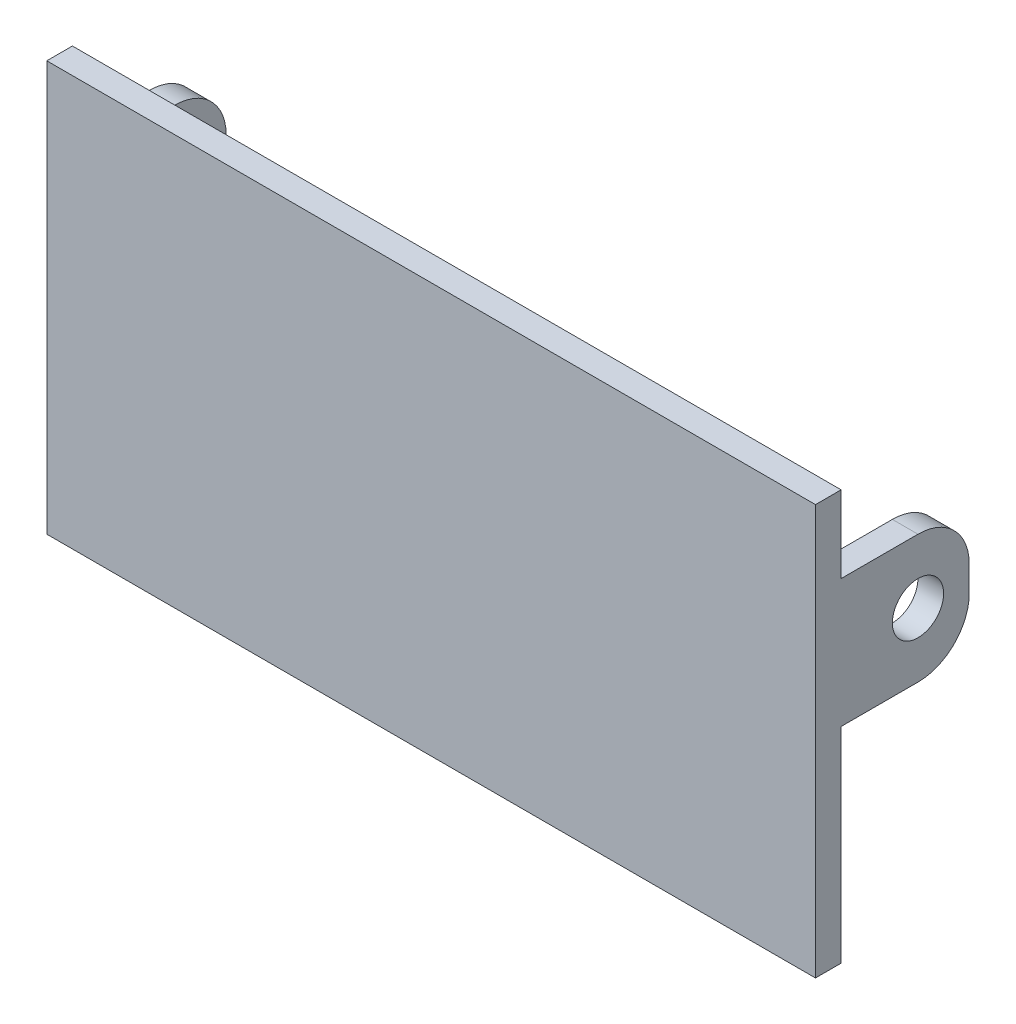
ISO-10303-21;
HEADER;
FILE_DESCRIPTION(('STEP AP214'),'2;1');
FILE_NAME('part.step','',(''),(''),'','','');
FILE_SCHEMA(('AUTOMOTIVE_DESIGN { 1 0 10303 214 1 1 1 1 }'));
ENDSEC;
DATA;
#1=APPLICATION_CONTEXT('core data for automotive mechanical design processes');
#2=APPLICATION_PROTOCOL_DEFINITION('international standard','automotive_design',2000,#1);
#3=PRODUCT_CONTEXT('',#1,'mechanical');
#4=PRODUCT('Part','Part','',(#3));
#5=PRODUCT_RELATED_PRODUCT_CATEGORY('part','',(#4));
#6=PRODUCT_DEFINITION_FORMATION('','',#4);
#7=PRODUCT_DEFINITION_CONTEXT('part definition',#1,'design');
#8=PRODUCT_DEFINITION('design','',#6,#7);
#9=PRODUCT_DEFINITION_SHAPE('','',#8);
#10=(LENGTH_UNIT() NAMED_UNIT(*) SI_UNIT(.MILLI.,.METRE.));
#11=(NAMED_UNIT(*) PLANE_ANGLE_UNIT() SI_UNIT($,.RADIAN.));
#12=(NAMED_UNIT(*) SI_UNIT($,.STERADIAN.) SOLID_ANGLE_UNIT());
#13=UNCERTAINTY_MEASURE_WITH_UNIT(LENGTH_MEASURE(1.E-05),#10,'distance_accuracy_value','');
#14=(GEOMETRIC_REPRESENTATION_CONTEXT(3) GLOBAL_UNCERTAINTY_ASSIGNED_CONTEXT((#13)) GLOBAL_UNIT_ASSIGNED_CONTEXT((#10,
#11,#12)) REPRESENTATION_CONTEXT('',''));
#15=CARTESIAN_POINT('',(0.,0.,0.));
#16=DIRECTION('',(0.,0.,1.));
#17=DIRECTION('',(1.,0.,0.));
#18=AXIS2_PLACEMENT_3D('',#15,#16,#17);
#19=CARTESIAN_POINT('',(0.,0.,0.));
#20=DIRECTION('',(0.,0.,1.));
#21=DIRECTION('',(1.,0.,0.));
#22=AXIS2_PLACEMENT_3D('',#19,#20,#21);
#23=PLANE('',#22);
#24=DIRECTION('',(1.,0.,0.));
#25=VECTOR('',#24,1.);
#26=CARTESIAN_POINT('',(-150.,65.,0.));
#27=LINE('',#26,#25);
#28=CARTESIAN_POINT('',(-150.,65.,0.));
#29=VERTEX_POINT('',#28);
#30=CARTESIAN_POINT('',(-145.,65.,0.));
#31=VERTEX_POINT('',#30);
#32=EDGE_CURVE('E151',#29,#31,#27,.T.);
#33=ORIENTED_EDGE('',*,*,#32,.F.);
#34=DIRECTION('',(0.,1.,0.));
#35=VECTOR('',#34,1.);
#36=CARTESIAN_POINT('',(-150.,0.,0.));
#37=LINE('',#36,#35);
#38=CARTESIAN_POINT('',(-150.,80.,0.));
#39=VERTEX_POINT('',#38);
#40=EDGE_CURVE('E160',#29,#39,#37,.T.);
#41=ORIENTED_EDGE('',*,*,#40,.T.);
#42=DIRECTION('',(-1.,0.,0.));
#43=VECTOR('',#42,1.);
#44=CARTESIAN_POINT('',(0.,80.,0.));
#45=LINE('',#44,#43);
#46=CARTESIAN_POINT('',(0.,80.,0.));
#47=VERTEX_POINT('',#46);
#48=EDGE_CURVE('E169',#47,#39,#45,.T.);
#49=ORIENTED_EDGE('',*,*,#48,.F.);
#50=DIRECTION('',(0.,1.,0.));
#51=VECTOR('',#50,1.);
#52=CARTESIAN_POINT('',(0.,0.,0.));
#53=LINE('',#52,#51);
#54=CARTESIAN_POINT('',(0.,65.,0.));
#55=VERTEX_POINT('',#54);
#56=EDGE_CURVE('E216',#55,#47,#53,.T.);
#57=ORIENTED_EDGE('',*,*,#56,.F.);
#58=DIRECTION('',(1.,0.,0.));
#59=VECTOR('',#58,1.);
#60=CARTESIAN_POINT('',(0.,65.,0.));
#61=LINE('',#60,#59);
#62=CARTESIAN_POINT('',(-5.,65.,0.));
#63=VERTEX_POINT('',#62);
#64=EDGE_CURVE('E198',#63,#55,#61,.T.);
#65=ORIENTED_EDGE('',*,*,#64,.F.);
#66=DIRECTION('',(0.,1.,0.));
#67=VECTOR('',#66,1.);
#68=CARTESIAN_POINT('',(-5.,65.,0.));
#69=LINE('',#68,#67);
#70=CARTESIAN_POINT('',(-5.00000000000001,40.,0.));
#71=VERTEX_POINT('',#70);
#72=EDGE_CURVE('E204',#71,#63,#69,.T.);
#73=ORIENTED_EDGE('',*,*,#72,.F.);
#74=DIRECTION('',(-1.,0.,0.));
#75=VECTOR('',#74,1.);
#76=CARTESIAN_POINT('',(0.,40.,0.));
#77=LINE('',#76,#75);
#78=CARTESIAN_POINT('',(0.,40.,0.));
#79=VERTEX_POINT('',#78);
#80=EDGE_CURVE('E156',#79,#71,#77,.T.);
#81=ORIENTED_EDGE('',*,*,#80,.F.);
#82=CARTESIAN_POINT('',(0.,0.,0.));
#83=VERTEX_POINT('',#82);
#84=EDGE_CURVE('E229',#83,#79,#53,.T.);
#85=ORIENTED_EDGE('',*,*,#84,.F.);
#86=DIRECTION('',(-1.,0.,0.));
#87=VECTOR('',#86,1.);
#88=CARTESIAN_POINT('',(0.,0.,0.));
#89=LINE('',#88,#87);
#90=CARTESIAN_POINT('',(-150.,0.,0.));
#91=VERTEX_POINT('',#90);
#92=EDGE_CURVE('E221',#83,#91,#89,.T.);
#93=ORIENTED_EDGE('',*,*,#92,.T.);
#94=CARTESIAN_POINT('',(-150.,40.,0.));
#95=VERTEX_POINT('',#94);
#96=EDGE_CURVE('E168',#91,#95,#37,.T.);
#97=ORIENTED_EDGE('',*,*,#96,.T.);
#98=DIRECTION('',(-1.,0.,0.));
#99=VECTOR('',#98,1.);
#100=CARTESIAN_POINT('',(-150.,40.,0.));
#101=LINE('',#100,#99);
#102=CARTESIAN_POINT('',(-145.,40.,0.));
#103=VERTEX_POINT('',#102);
#104=EDGE_CURVE('E177',#103,#95,#101,.T.);
#105=ORIENTED_EDGE('',*,*,#104,.F.);
#106=DIRECTION('',(0.,-1.,0.));
#107=VECTOR('',#106,1.);
#108=CARTESIAN_POINT('',(-145.,65.,0.));
#109=LINE('',#108,#107);
#110=EDGE_CURVE('E174',#31,#103,#109,.T.);
#111=ORIENTED_EDGE('',*,*,#110,.F.);
#112=EDGE_LOOP('',(#33,#41,#49,#57,#65,#73,#81,#85,#93,#97,#105,#111));
#113=FACE_BOUND('',#112,.T.);
#114=ADVANCED_FACE('F33',(#113),#23,.F.);
#115=CARTESIAN_POINT('',(0.,0.,5.));
#116=DIRECTION('',(-1.,0.,0.));
#117=DIRECTION('',(0.,-1.,0.));
#118=AXIS2_PLACEMENT_3D('',#115,#116,#117);
#119=PLANE('',#118);
#120=CARTESIAN_POINT('',(0.,52.5,-15.));
#121=DIRECTION('',(1.,0.,0.));
#122=DIRECTION('',(0.,1.,0.));
#123=AXIS2_PLACEMENT_3D('',#120,#121,#122);
#124=CIRCLE('',#123,5.);
#125=CARTESIAN_POINT('',(0.,57.5,-15.));
#126=VERTEX_POINT('',#125);
#127=EDGE_CURVE('E323',#126,#126,#124,.T.);
#128=ORIENTED_EDGE('',*,*,#127,.F.);
#129=EDGE_LOOP('',(#128));
#130=FACE_BOUND('',#129,.T.);
#131=DIRECTION('',(0.,-1.,0.));
#132=VECTOR('',#131,1.);
#133=CARTESIAN_POINT('',(0.,65.,-25.));
#134=LINE('',#133,#132);
#135=CARTESIAN_POINT('',(0.,55.,-25.));
#136=VERTEX_POINT('',#135);
#137=CARTESIAN_POINT('',(0.,50.,-25.));
#138=VERTEX_POINT('',#137);
#139=EDGE_CURVE('E194',#136,#138,#134,.T.);
#140=ORIENTED_EDGE('',*,*,#139,.F.);
#141=CARTESIAN_POINT('',(0.,55.,-15.));
#142=DIRECTION('',(-1.,0.,0.));
#143=DIRECTION('',(0.,-1.,0.));
#144=AXIS2_PLACEMENT_3D('',#141,#142,#143);
#145=CIRCLE('',#144,10.);
#146=CARTESIAN_POINT('',(0.,65.,-15.));
#147=VERTEX_POINT('',#146);
#148=EDGE_CURVE('E271',#136,#147,#145,.F.);
#149=ORIENTED_EDGE('',*,*,#148,.T.);
#150=DIRECTION('',(0.,0.,1.));
#151=VECTOR('',#150,1.);
#152=CARTESIAN_POINT('',(0.,65.,-25.));
#153=LINE('',#152,#151);
#154=EDGE_CURVE('E201',#147,#55,#153,.T.);
#155=ORIENTED_EDGE('',*,*,#154,.T.);
#156=ORIENTED_EDGE('',*,*,#56,.T.);
#157=DIRECTION('',(0.,0.,-1.));
#158=VECTOR('',#157,1.);
#159=CARTESIAN_POINT('',(0.,80.,5.));
#160=LINE('',#159,#158);
#161=CARTESIAN_POINT('',(0.,80.,5.));
#162=VERTEX_POINT('',#161);
#163=EDGE_CURVE('E240',#162,#47,#160,.T.);
#164=ORIENTED_EDGE('',*,*,#163,.F.);
#165=DIRECTION('',(0.,1.,0.));
#166=VECTOR('',#165,1.);
#167=CARTESIAN_POINT('',(0.,0.,5.));
#168=LINE('',#167,#166);
#169=CARTESIAN_POINT('',(0.,0.,5.));
#170=VERTEX_POINT('',#169);
#171=EDGE_CURVE('E217',#170,#162,#168,.T.);
#172=ORIENTED_EDGE('',*,*,#171,.F.);
#173=DIRECTION('',(0.,0.,-1.));
#174=VECTOR('',#173,1.);
#175=CARTESIAN_POINT('',(0.,0.,5.));
#176=LINE('',#175,#174);
#177=EDGE_CURVE('E228',#170,#83,#176,.T.);
#178=ORIENTED_EDGE('',*,*,#177,.T.);
#179=ORIENTED_EDGE('',*,*,#84,.T.);
#180=DIRECTION('',(0.,0.,1.));
#181=VECTOR('',#180,1.);
#182=CARTESIAN_POINT('',(0.,40.,-25.));
#183=LINE('',#182,#181);
#184=CARTESIAN_POINT('',(0.,40.,-15.));
#185=VERTEX_POINT('',#184);
#186=EDGE_CURVE('E214',#185,#79,#183,.T.);
#187=ORIENTED_EDGE('',*,*,#186,.F.);
#188=CARTESIAN_POINT('',(0.,50.,-15.));
#189=DIRECTION('',(-1.,0.,0.));
#190=DIRECTION('',(0.,-1.,0.));
#191=AXIS2_PLACEMENT_3D('',#188,#189,#190);
#192=CIRCLE('',#191,10.);
#193=EDGE_CURVE('E269',#185,#138,#192,.F.);
#194=ORIENTED_EDGE('',*,*,#193,.T.);
#195=EDGE_LOOP('',(#140,#149,#155,#156,#164,#172,#178,#179,#187,#194));
#196=FACE_BOUND('',#195,.T.);
#197=ADVANCED_FACE('F284',(#130,#196),#119,.F.);
#198=CARTESIAN_POINT('',(0.,80.,5.));
#199=DIRECTION('',(0.,-1.,0.));
#200=DIRECTION('',(1.,0.,0.));
#201=AXIS2_PLACEMENT_3D('',#198,#199,#200);
#202=PLANE('',#201);
#203=ORIENTED_EDGE('',*,*,#48,.T.);
#204=DIRECTION('',(0.,0.,-1.));
#205=VECTOR('',#204,1.);
#206=CARTESIAN_POINT('',(-150.,80.,5.));
#207=LINE('',#206,#205);
#208=CARTESIAN_POINT('',(-150.,80.,5.));
#209=VERTEX_POINT('',#208);
#210=EDGE_CURVE('E164',#209,#39,#207,.T.);
#211=ORIENTED_EDGE('',*,*,#210,.F.);
#212=DIRECTION('',(-1.,0.,0.));
#213=VECTOR('',#212,1.);
#214=CARTESIAN_POINT('',(0.,80.,5.));
#215=LINE('',#214,#213);
#216=EDGE_CURVE('E220',#162,#209,#215,.T.);
#217=ORIENTED_EDGE('',*,*,#216,.F.);
#218=ORIENTED_EDGE('',*,*,#163,.T.);
#219=EDGE_LOOP('',(#203,#211,#217,#218));
#220=FACE_BOUND('',#219,.T.);
#221=ADVANCED_FACE('F350',(#220),#202,.F.);
#222=CARTESIAN_POINT('',(-150.,0.,5.));
#223=DIRECTION('',(-1.,0.,0.));
#224=DIRECTION('',(0.,0.,1.));
#225=AXIS2_PLACEMENT_3D('',#222,#223,#224);
#226=PLANE('',#225);
#227=CARTESIAN_POINT('',(-150.,52.5,-15.));
#228=DIRECTION('',(1.,0.,0.));
#229=DIRECTION('',(0.,1.,0.));
#230=AXIS2_PLACEMENT_3D('',#227,#228,#229);
#231=CIRCLE('',#230,5.);
#232=CARTESIAN_POINT('',(-150.,57.5,-15.));
#233=VERTEX_POINT('',#232);
#234=EDGE_CURVE('E246',#233,#233,#231,.T.);
#235=ORIENTED_EDGE('',*,*,#234,.T.);
#236=EDGE_LOOP('',(#235));
#237=FACE_BOUND('',#236,.T.);
#238=DIRECTION('',(0.,0.,1.));
#239=VECTOR('',#238,1.);
#240=CARTESIAN_POINT('',(-150.,65.,-25.));
#241=LINE('',#240,#239);
#242=CARTESIAN_POINT('',(-150.,65.,-15.));
#243=VERTEX_POINT('',#242);
#244=EDGE_CURVE('E146',#243,#29,#241,.T.);
#245=ORIENTED_EDGE('',*,*,#244,.F.);
#246=CARTESIAN_POINT('',(-150.,55.,-15.));
#247=DIRECTION('',(-1.,0.,0.));
#248=DIRECTION('',(0.,0.,1.));
#249=AXIS2_PLACEMENT_3D('',#246,#247,#248);
#250=CIRCLE('',#249,10.);
#251=CARTESIAN_POINT('',(-150.,55.,-25.));
#252=VERTEX_POINT('',#251);
#253=EDGE_CURVE('E259',#243,#252,#250,.T.);
#254=ORIENTED_EDGE('',*,*,#253,.T.);
#255=DIRECTION('',(0.,1.,0.));
#256=VECTOR('',#255,1.);
#257=CARTESIAN_POINT('',(-150.,65.,-25.));
#258=LINE('',#257,#256);
#259=CARTESIAN_POINT('',(-150.,50.,-25.));
#260=VERTEX_POINT('',#259);
#261=EDGE_CURVE('E188',#260,#252,#258,.T.);
#262=ORIENTED_EDGE('',*,*,#261,.F.);
#263=CARTESIAN_POINT('',(-150.,50.,-15.));
#264=DIRECTION('',(-1.,0.,0.));
#265=DIRECTION('',(0.,0.,1.));
#266=AXIS2_PLACEMENT_3D('',#263,#264,#265);
#267=CIRCLE('',#266,10.);
#268=CARTESIAN_POINT('',(-150.,40.,-15.));
#269=VERTEX_POINT('',#268);
#270=EDGE_CURVE('E257',#260,#269,#267,.T.);
#271=ORIENTED_EDGE('',*,*,#270,.T.);
#272=DIRECTION('',(0.,0.,1.));
#273=VECTOR('',#272,1.);
#274=CARTESIAN_POINT('',(-150.,40.,-25.));
#275=LINE('',#274,#273);
#276=EDGE_CURVE('E189',#269,#95,#275,.T.);
#277=ORIENTED_EDGE('',*,*,#276,.T.);
#278=ORIENTED_EDGE('',*,*,#96,.F.);
#279=DIRECTION('',(0.,0.,-1.));
#280=VECTOR('',#279,1.);
#281=CARTESIAN_POINT('',(-150.,0.,5.));
#282=LINE('',#281,#280);
#283=CARTESIAN_POINT('',(-150.,0.,5.));
#284=VERTEX_POINT('',#283);
#285=EDGE_CURVE('E237',#284,#91,#282,.T.);
#286=ORIENTED_EDGE('',*,*,#285,.F.);
#287=DIRECTION('',(0.,1.,0.));
#288=VECTOR('',#287,1.);
#289=CARTESIAN_POINT('',(-150.,0.,5.));
#290=LINE('',#289,#288);
#291=EDGE_CURVE('E223',#284,#209,#290,.T.);
#292=ORIENTED_EDGE('',*,*,#291,.T.);
#293=ORIENTED_EDGE('',*,*,#210,.T.);
#294=ORIENTED_EDGE('',*,*,#40,.F.);
#295=EDGE_LOOP('',(#245,#254,#262,#271,#277,#278,#286,#292,#293,#294));
#296=FACE_BOUND('',#295,.T.);
#297=ADVANCED_FACE('F161',(#237,#296),#226,.T.);
#298=CARTESIAN_POINT('',(0.,0.,5.));
#299=DIRECTION('',(0.,-1.,0.));
#300=DIRECTION('',(1.,0.,0.));
#301=AXIS2_PLACEMENT_3D('',#298,#299,#300);
#302=PLANE('',#301);
#303=ORIENTED_EDGE('',*,*,#92,.F.);
#304=ORIENTED_EDGE('',*,*,#177,.F.);
#305=DIRECTION('',(-1.,0.,0.));
#306=VECTOR('',#305,1.);
#307=CARTESIAN_POINT('',(0.,0.,5.));
#308=LINE('',#307,#306);
#309=EDGE_CURVE('E225',#170,#284,#308,.T.);
#310=ORIENTED_EDGE('',*,*,#309,.T.);
#311=ORIENTED_EDGE('',*,*,#285,.T.);
#312=EDGE_LOOP('',(#303,#304,#310,#311));
#313=FACE_BOUND('',#312,.T.);
#314=ADVANCED_FACE('F299',(#313),#302,.T.);
#315=CARTESIAN_POINT('',(0.,0.,5.));
#316=DIRECTION('',(0.,0.,1.));
#317=DIRECTION('',(1.,0.,0.));
#318=AXIS2_PLACEMENT_3D('',#315,#316,#317);
#319=PLANE('',#318);
#320=ORIENTED_EDGE('',*,*,#171,.T.);
#321=ORIENTED_EDGE('',*,*,#216,.T.);
#322=ORIENTED_EDGE('',*,*,#291,.F.);
#323=ORIENTED_EDGE('',*,*,#309,.F.);
#324=EDGE_LOOP('',(#320,#321,#322,#323));
#325=FACE_BOUND('',#324,.T.);
#326=ADVANCED_FACE('F355',(#325),#319,.T.);
#327=CARTESIAN_POINT('',(0.,40.,-25.));
#328=DIRECTION('',(0.,1.,0.));
#329=DIRECTION('',(0.,0.,1.));
#330=AXIS2_PLACEMENT_3D('',#327,#328,#329);
#331=PLANE('',#330);
#332=DIRECTION('',(0.,0.,1.));
#333=VECTOR('',#332,1.);
#334=CARTESIAN_POINT('',(-5.00000000000001,40.,-25.));
#335=LINE('',#334,#333);
#336=CARTESIAN_POINT('',(-5.00000000000001,40.,-15.));
#337=VERTEX_POINT('',#336);
#338=EDGE_CURVE('E212',#337,#71,#335,.T.);
#339=ORIENTED_EDGE('',*,*,#338,.F.);
#340=DIRECTION('',(-1.,0.,0.));
#341=VECTOR('',#340,1.);
#342=CARTESIAN_POINT('',(0.,40.,-15.));
#343=LINE('',#342,#341);
#344=EDGE_CURVE('E11',#337,#185,#343,.F.);
#345=ORIENTED_EDGE('',*,*,#344,.T.);
#346=ORIENTED_EDGE('',*,*,#186,.T.);
#347=ORIENTED_EDGE('',*,*,#80,.T.);
#348=EDGE_LOOP('',(#339,#345,#346,#347));
#349=FACE_BOUND('',#348,.T.);
#350=ADVANCED_FACE('F292',(#349),#331,.F.);
#351=CARTESIAN_POINT('',(-5.,65.,-25.));
#352=DIRECTION('',(1.,0.,0.));
#353=DIRECTION('',(0.,1.,0.));
#354=AXIS2_PLACEMENT_3D('',#351,#352,#353);
#355=PLANE('',#354);
#356=CARTESIAN_POINT('',(-5.,52.5,-15.));
#357=DIRECTION('',(1.,0.,0.));
#358=DIRECTION('',(0.,1.,0.));
#359=AXIS2_PLACEMENT_3D('',#356,#357,#358);
#360=CIRCLE('',#359,5.);
#361=CARTESIAN_POINT('',(-5.,57.5,-15.));
#362=VERTEX_POINT('',#361);
#363=EDGE_CURVE('E175',#362,#362,#360,.T.);
#364=ORIENTED_EDGE('',*,*,#363,.T.);
#365=EDGE_LOOP('',(#364));
#366=FACE_BOUND('',#365,.T.);
#367=DIRECTION('',(0.,0.,1.));
#368=VECTOR('',#367,1.);
#369=CARTESIAN_POINT('',(-5.,65.,-25.));
#370=LINE('',#369,#368);
#371=CARTESIAN_POINT('',(-5.,65.,-15.));
#372=VERTEX_POINT('',#371);
#373=EDGE_CURVE('E210',#372,#63,#370,.T.);
#374=ORIENTED_EDGE('',*,*,#373,.F.);
#375=CARTESIAN_POINT('',(-5.,55.,-15.));
#376=DIRECTION('',(1.,0.,0.));
#377=DIRECTION('',(0.,1.,0.));
#378=AXIS2_PLACEMENT_3D('',#375,#376,#377);
#379=CIRCLE('',#378,10.);
#380=CARTESIAN_POINT('',(-5.,55.,-25.));
#381=VERTEX_POINT('',#380);
#382=EDGE_CURVE('E41',#372,#381,#379,.F.);
#383=ORIENTED_EDGE('',*,*,#382,.T.);
#384=DIRECTION('',(0.,1.,0.));
#385=VECTOR('',#384,1.);
#386=CARTESIAN_POINT('',(-5.,65.,-25.));
#387=LINE('',#386,#385);
#388=CARTESIAN_POINT('',(-5.,50.,-25.));
#389=VERTEX_POINT('',#388);
#390=EDGE_CURVE('E197',#389,#381,#387,.T.);
#391=ORIENTED_EDGE('',*,*,#390,.F.);
#392=CARTESIAN_POINT('',(-5.,50.,-15.));
#393=DIRECTION('',(1.,0.,0.));
#394=DIRECTION('',(0.,1.,0.));
#395=AXIS2_PLACEMENT_3D('',#392,#393,#394);
#396=CIRCLE('',#395,10.);
#397=EDGE_CURVE('E48',#389,#337,#396,.F.);
#398=ORIENTED_EDGE('',*,*,#397,.T.);
#399=ORIENTED_EDGE('',*,*,#338,.T.);
#400=ORIENTED_EDGE('',*,*,#72,.T.);
#401=EDGE_LOOP('',(#374,#383,#391,#398,#399,#400));
#402=FACE_BOUND('',#401,.T.);
#403=ADVANCED_FACE('F275',(#366,#402),#355,.F.);
#404=CARTESIAN_POINT('',(0.,65.,-25.));
#405=DIRECTION('',(0.,-1.,0.));
#406=DIRECTION('',(0.,0.,-1.));
#407=AXIS2_PLACEMENT_3D('',#404,#405,#406);
#408=PLANE('',#407);
#409=ORIENTED_EDGE('',*,*,#154,.F.);
#410=DIRECTION('',(1.,0.,0.));
#411=VECTOR('',#410,1.);
#412=CARTESIAN_POINT('',(-5.,65.,-15.));
#413=LINE('',#412,#411);
#414=EDGE_CURVE('E56',#147,#372,#413,.F.);
#415=ORIENTED_EDGE('',*,*,#414,.T.);
#416=ORIENTED_EDGE('',*,*,#373,.T.);
#417=ORIENTED_EDGE('',*,*,#64,.T.);
#418=EDGE_LOOP('',(#409,#415,#416,#417));
#419=FACE_BOUND('',#418,.T.);
#420=ADVANCED_FACE('F286',(#419),#408,.F.);
#421=CARTESIAN_POINT('',(0.,0.,-25.));
#422=DIRECTION('',(0.,0.,-1.));
#423=DIRECTION('',(-1.,0.,0.));
#424=AXIS2_PLACEMENT_3D('',#421,#422,#423);
#425=PLANE('',#424);
#426=ORIENTED_EDGE('',*,*,#390,.T.);
#427=DIRECTION('',(1.,0.,0.));
#428=VECTOR('',#427,1.);
#429=CARTESIAN_POINT('',(0.,55.,-25.));
#430=LINE('',#429,#428);
#431=EDGE_CURVE('E266',#381,#136,#430,.T.);
#432=ORIENTED_EDGE('',*,*,#431,.T.);
#433=ORIENTED_EDGE('',*,*,#139,.T.);
#434=DIRECTION('',(-1.,0.,0.));
#435=VECTOR('',#434,1.);
#436=CARTESIAN_POINT('',(-5.00000000000001,50.,-25.));
#437=LINE('',#436,#435);
#438=EDGE_CURVE('E263',#138,#389,#437,.T.);
#439=ORIENTED_EDGE('',*,*,#438,.T.);
#440=EDGE_LOOP('',(#426,#432,#433,#439));
#441=FACE_BOUND('',#440,.T.);
#442=ADVANCED_FACE('F279',(#441),#425,.T.);
#443=CARTESIAN_POINT('',(-150.,65.,-25.));
#444=DIRECTION('',(0.,-1.,0.));
#445=DIRECTION('',(0.,0.,-1.));
#446=AXIS2_PLACEMENT_3D('',#443,#444,#445);
#447=PLANE('',#446);
#448=DIRECTION('',(0.,0.,1.));
#449=VECTOR('',#448,1.);
#450=CARTESIAN_POINT('',(-145.,65.,-25.));
#451=LINE('',#450,#449);
#452=CARTESIAN_POINT('',(-145.,65.,-15.));
#453=VERTEX_POINT('',#452);
#454=EDGE_CURVE('E157',#453,#31,#451,.T.);
#455=ORIENTED_EDGE('',*,*,#454,.F.);
#456=DIRECTION('',(1.,0.,0.));
#457=VECTOR('',#456,1.);
#458=CARTESIAN_POINT('',(-150.,65.,-15.));
#459=LINE('',#458,#457);
#460=EDGE_CURVE('E153',#453,#243,#459,.F.);
#461=ORIENTED_EDGE('',*,*,#460,.T.);
#462=ORIENTED_EDGE('',*,*,#244,.T.);
#463=ORIENTED_EDGE('',*,*,#32,.T.);
#464=EDGE_LOOP('',(#455,#461,#462,#463));
#465=FACE_BOUND('',#464,.T.);
#466=ADVANCED_FACE('F149',(#465),#447,.F.);
#467=CARTESIAN_POINT('',(-145.,65.,-25.));
#468=DIRECTION('',(-1.,0.,0.));
#469=DIRECTION('',(0.,0.,1.));
#470=AXIS2_PLACEMENT_3D('',#467,#468,#469);
#471=PLANE('',#470);
#472=CARTESIAN_POINT('',(-145.,52.5,-15.));
#473=DIRECTION('',(-1.,0.,0.));
#474=DIRECTION('',(0.,0.,1.));
#475=AXIS2_PLACEMENT_3D('',#472,#473,#474);
#476=CIRCLE('',#475,5.);
#477=CARTESIAN_POINT('',(-145.,52.5,-10.));
#478=VERTEX_POINT('',#477);
#479=EDGE_CURVE('E180',#478,#478,#476,.T.);
#480=ORIENTED_EDGE('',*,*,#479,.T.);
#481=EDGE_LOOP('',(#480));
#482=FACE_BOUND('',#481,.T.);
#483=DIRECTION('',(0.,-1.,0.));
#484=VECTOR('',#483,1.);
#485=CARTESIAN_POINT('',(-145.,65.,-25.));
#486=LINE('',#485,#484);
#487=CARTESIAN_POINT('',(-145.,55.,-25.));
#488=VERTEX_POINT('',#487);
#489=CARTESIAN_POINT('',(-145.,50.,-25.));
#490=VERTEX_POINT('',#489);
#491=EDGE_CURVE('E183',#488,#490,#486,.T.);
#492=ORIENTED_EDGE('',*,*,#491,.F.);
#493=CARTESIAN_POINT('',(-145.,55.,-15.));
#494=DIRECTION('',(-1.,0.,0.));
#495=DIRECTION('',(0.,0.,1.));
#496=AXIS2_PLACEMENT_3D('',#493,#494,#495);
#497=CIRCLE('',#496,10.);
#498=EDGE_CURVE('E254',#488,#453,#497,.F.);
#499=ORIENTED_EDGE('',*,*,#498,.T.);
#500=ORIENTED_EDGE('',*,*,#454,.T.);
#501=ORIENTED_EDGE('',*,*,#110,.T.);
#502=DIRECTION('',(0.,0.,1.));
#503=VECTOR('',#502,1.);
#504=CARTESIAN_POINT('',(-145.,40.,-25.));
#505=LINE('',#504,#503);
#506=CARTESIAN_POINT('',(-145.,40.,-15.));
#507=VERTEX_POINT('',#506);
#508=EDGE_CURVE('E191',#507,#103,#505,.T.);
#509=ORIENTED_EDGE('',*,*,#508,.F.);
#510=CARTESIAN_POINT('',(-145.,50.,-15.));
#511=DIRECTION('',(-1.,0.,0.));
#512=DIRECTION('',(0.,0.,1.));
#513=AXIS2_PLACEMENT_3D('',#510,#511,#512);
#514=CIRCLE('',#513,10.);
#515=EDGE_CURVE('E252',#507,#490,#514,.F.);
#516=ORIENTED_EDGE('',*,*,#515,.T.);
#517=EDGE_LOOP('',(#492,#499,#500,#501,#509,#516));
#518=FACE_BOUND('',#517,.T.);
#519=ADVANCED_FACE('F312',(#482,#518),#471,.F.);
#520=CARTESIAN_POINT('',(-150.,40.,-25.));
#521=DIRECTION('',(0.,1.,0.));
#522=DIRECTION('',(0.,0.,1.));
#523=AXIS2_PLACEMENT_3D('',#520,#521,#522);
#524=PLANE('',#523);
#525=ORIENTED_EDGE('',*,*,#276,.F.);
#526=DIRECTION('',(-1.,0.,0.));
#527=VECTOR('',#526,1.);
#528=CARTESIAN_POINT('',(-150.,40.,-15.));
#529=LINE('',#528,#527);
#530=EDGE_CURVE('E261',#269,#507,#529,.F.);
#531=ORIENTED_EDGE('',*,*,#530,.T.);
#532=ORIENTED_EDGE('',*,*,#508,.T.);
#533=ORIENTED_EDGE('',*,*,#104,.T.);
#534=EDGE_LOOP('',(#525,#531,#532,#533));
#535=FACE_BOUND('',#534,.T.);
#536=ADVANCED_FACE('F306',(#535),#524,.F.);
#537=CARTESIAN_POINT('',(0.,0.,-25.));
#538=DIRECTION('',(0.,0.,1.));
#539=DIRECTION('',(1.,0.,0.));
#540=AXIS2_PLACEMENT_3D('',#537,#538,#539);
#541=PLANE('',#540);
#542=ORIENTED_EDGE('',*,*,#261,.T.);
#543=DIRECTION('',(1.,0.,0.));
#544=VECTOR('',#543,1.);
#545=CARTESIAN_POINT('',(0.,55.,-25.));
#546=LINE('',#545,#544);
#547=EDGE_CURVE('E249',#252,#488,#546,.T.);
#548=ORIENTED_EDGE('',*,*,#547,.T.);
#549=ORIENTED_EDGE('',*,*,#491,.T.);
#550=DIRECTION('',(-1.,0.,0.));
#551=VECTOR('',#550,1.);
#552=CARTESIAN_POINT('',(0.,50.,-25.));
#553=LINE('',#552,#551);
#554=EDGE_CURVE('E243',#490,#260,#553,.T.);
#555=ORIENTED_EDGE('',*,*,#554,.T.);
#556=EDGE_LOOP('',(#542,#548,#549,#555));
#557=FACE_BOUND('',#556,.T.);
#558=ADVANCED_FACE('F320',(#557),#541,.F.);
#559=CARTESIAN_POINT('',(-150.,52.5,-15.));
#560=DIRECTION('',(1.,0.,0.));
#561=DIRECTION('',(0.,1.,0.));
#562=AXIS2_PLACEMENT_3D('',#559,#560,#561);
#563=CYLINDRICAL_SURFACE('',#562,5.);
#564=ORIENTED_EDGE('',*,*,#234,.F.);
#565=EDGE_LOOP('',(#564));
#566=FACE_BOUND('',#565,.T.);
#567=ORIENTED_EDGE('',*,*,#479,.F.);
#568=EDGE_LOOP('',(#567));
#569=FACE_BOUND('',#568,.T.);
#570=ADVANCED_FACE('F330',(#566,#569),#563,.F.);
#571=ORIENTED_EDGE('',*,*,#127,.T.);
#572=EDGE_LOOP('',(#571));
#573=FACE_BOUND('',#572,.T.);
#574=ORIENTED_EDGE('',*,*,#363,.F.);
#575=EDGE_LOOP('',(#574));
#576=FACE_BOUND('',#575,.T.);
#577=ADVANCED_FACE('F333',(#573,#576),#563,.F.);
#578=CARTESIAN_POINT('',(0.,55.,-15.));
#579=DIRECTION('',(1.,0.,0.));
#580=DIRECTION('',(0.,0.,-1.));
#581=AXIS2_PLACEMENT_3D('',#578,#579,#580);
#582=CYLINDRICAL_SURFACE('',#581,10.);
#583=ORIENTED_EDGE('',*,*,#253,.F.);
#584=ORIENTED_EDGE('',*,*,#460,.F.);
#585=ORIENTED_EDGE('',*,*,#498,.F.);
#586=ORIENTED_EDGE('',*,*,#547,.F.);
#587=EDGE_LOOP('',(#583,#584,#585,#586));
#588=FACE_BOUND('',#587,.T.);
#589=ADVANCED_FACE('F364',(#588),#582,.T.);
#590=CARTESIAN_POINT('',(0.,50.,-15.));
#591=DIRECTION('',(-1.,0.,0.));
#592=DIRECTION('',(0.,0.,1.));
#593=AXIS2_PLACEMENT_3D('',#590,#591,#592);
#594=CYLINDRICAL_SURFACE('',#593,10.);
#595=ORIENTED_EDGE('',*,*,#515,.F.);
#596=ORIENTED_EDGE('',*,*,#530,.F.);
#597=ORIENTED_EDGE('',*,*,#270,.F.);
#598=ORIENTED_EDGE('',*,*,#554,.F.);
#599=EDGE_LOOP('',(#595,#596,#597,#598));
#600=FACE_BOUND('',#599,.T.);
#601=ADVANCED_FACE('F316',(#600),#594,.T.);
#602=CARTESIAN_POINT('',(0.,55.,-15.));
#603=DIRECTION('',(-1.,0.,0.));
#604=DIRECTION('',(0.,0.,1.));
#605=AXIS2_PLACEMENT_3D('',#602,#603,#604);
#606=CYLINDRICAL_SURFACE('',#605,10.);
#607=ORIENTED_EDGE('',*,*,#382,.F.);
#608=ORIENTED_EDGE('',*,*,#414,.F.);
#609=ORIENTED_EDGE('',*,*,#148,.F.);
#610=ORIENTED_EDGE('',*,*,#431,.F.);
#611=EDGE_LOOP('',(#607,#608,#609,#610));
#612=FACE_BOUND('',#611,.T.);
#613=ADVANCED_FACE('F282',(#612),#606,.T.);
#614=CARTESIAN_POINT('',(0.,50.,-15.));
#615=DIRECTION('',(1.,0.,0.));
#616=DIRECTION('',(0.,0.,-1.));
#617=AXIS2_PLACEMENT_3D('',#614,#615,#616);
#618=CYLINDRICAL_SURFACE('',#617,10.);
#619=ORIENTED_EDGE('',*,*,#193,.F.);
#620=ORIENTED_EDGE('',*,*,#344,.F.);
#621=ORIENTED_EDGE('',*,*,#397,.F.);
#622=ORIENTED_EDGE('',*,*,#438,.F.);
#623=EDGE_LOOP('',(#619,#620,#621,#622));
#624=FACE_BOUND('',#623,.T.);
#625=ADVANCED_FACE('F35',(#624),#618,.T.);
#626=CLOSED_SHELL('',(#114,#197,#221,#297,#314,#326,#350,#403,#420,#442,#466,#519,#536,#558,
#570,#577,#589,#601,#613,#625));
#627=MANIFOLD_SOLID_BREP('B2',#626);
#628=ADVANCED_BREP_SHAPE_REPRESENTATION('',(#18,#627),#14);
#629=SHAPE_DEFINITION_REPRESENTATION(#9,#628);
ENDSEC;
END-ISO-10303-21;
